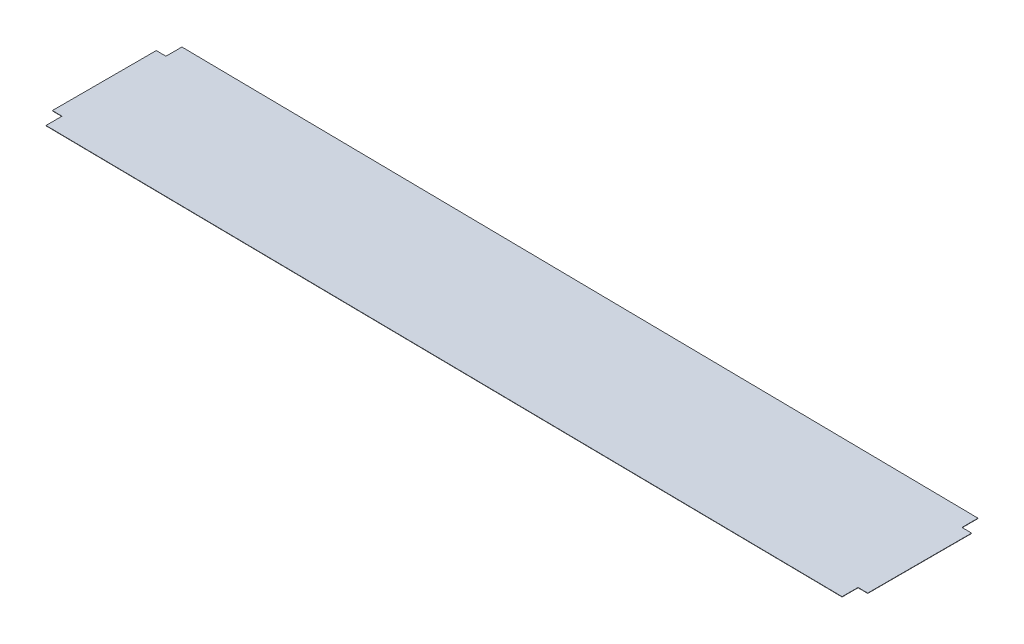
ISO-10303-21;
HEADER;
FILE_DESCRIPTION(('STEP AP214'),'2;1');
FILE_NAME('part.step','',(''),(''),'','','');
FILE_SCHEMA(('AUTOMOTIVE_DESIGN { 1 0 10303 214 1 1 1 1 }'));
ENDSEC;
DATA;
#1=APPLICATION_CONTEXT('core data for automotive mechanical design processes');
#2=APPLICATION_PROTOCOL_DEFINITION('international standard','automotive_design',2000,#1);
#3=PRODUCT_CONTEXT('',#1,'mechanical');
#4=PRODUCT('Part','Part','',(#3));
#5=PRODUCT_RELATED_PRODUCT_CATEGORY('part','',(#4));
#6=PRODUCT_DEFINITION_FORMATION('','',#4);
#7=PRODUCT_DEFINITION_CONTEXT('part definition',#1,'design');
#8=PRODUCT_DEFINITION('design','',#6,#7);
#9=PRODUCT_DEFINITION_SHAPE('','',#8);
#10=(LENGTH_UNIT() NAMED_UNIT(*) SI_UNIT(.MILLI.,.METRE.));
#11=(NAMED_UNIT(*) PLANE_ANGLE_UNIT() SI_UNIT($,.RADIAN.));
#12=(NAMED_UNIT(*) SI_UNIT($,.STERADIAN.) SOLID_ANGLE_UNIT());
#13=UNCERTAINTY_MEASURE_WITH_UNIT(LENGTH_MEASURE(1.E-05),#10,'distance_accuracy_value','');
#14=(GEOMETRIC_REPRESENTATION_CONTEXT(3) GLOBAL_UNCERTAINTY_ASSIGNED_CONTEXT((#13)) GLOBAL_UNIT_ASSIGNED_CONTEXT((#10,
#11,#12)) REPRESENTATION_CONTEXT('',''));
#15=CARTESIAN_POINT('',(0.,0.,0.));
#16=DIRECTION('',(0.,0.,1.));
#17=DIRECTION('',(1.,0.,0.));
#18=AXIS2_PLACEMENT_3D('',#15,#16,#17);
#19=CARTESIAN_POINT('',(-2.0251923119604,-160.765843728774,74.));
#20=DIRECTION('',(0.999920665280262,-0.0125961559801988,0.));
#21=DIRECTION('',(0.,0.,1.));
#22=AXIS2_PLACEMENT_3D('',#19,#20,#21);
#23=PLANE('',#22);
#24=DIRECTION('',(0.,0.,1.));
#25=VECTOR('',#24,1.);
#26=CARTESIAN_POINT('',(-2.03023077435248,-161.165811994886,74.));
#27=LINE('',#26,#25);
#28=CARTESIAN_POINT('',(-2.03023077435246,-161.165811994887,216.359309142724));
#29=VERTEX_POINT('',#28);
#30=CARTESIAN_POINT('',(-2.03023077435249,-161.165811994887,236.359309142724));
#31=VERTEX_POINT('',#30);
#32=EDGE_CURVE('E159',#29,#31,#27,.T.);
#33=ORIENTED_EDGE('',*,*,#32,.F.);
#34=DIRECTION('',(0.0125961559801988,0.999920665280262,0.));
#35=VECTOR('',#34,1.);
#36=CARTESIAN_POINT('',(-2.03023077435246,-161.165811994887,216.359309142724));
#37=LINE('',#36,#35);
#38=CARTESIAN_POINT('',(-2.0251923119604,-160.765843728774,216.359309142724));
#39=VERTEX_POINT('',#38);
#40=EDGE_CURVE('E144',#29,#39,#37,.T.);
#41=ORIENTED_EDGE('',*,*,#40,.T.);
#42=DIRECTION('',(0.,0.,1.));
#43=VECTOR('',#42,1.);
#44=CARTESIAN_POINT('',(-2.0251923119604,-160.765843728774,74.));
#45=LINE('',#44,#43);
#46=CARTESIAN_POINT('',(-2.02519231196041,-160.765843728775,236.359309142724));
#47=VERTEX_POINT('',#46);
#48=EDGE_CURVE('E178',#39,#47,#45,.T.);
#49=ORIENTED_EDGE('',*,*,#48,.T.);
#50=DIRECTION('',(-0.0125961559801988,-0.999920665280262,0.));
#51=VECTOR('',#50,1.);
#52=CARTESIAN_POINT('',(-2.02519231196041,-160.765843728775,236.359309142724));
#53=LINE('',#52,#51);
#54=EDGE_CURVE('E167',#47,#31,#53,.T.);
#55=ORIENTED_EDGE('',*,*,#54,.T.);
#56=EDGE_LOOP('',(#33,#41,#49,#55));
#57=FACE_BOUND('',#56,.T.);
#58=ADVANCED_FACE('F55',(#57),#23,.T.);
#59=CARTESIAN_POINT('',(-996.264935971483,-148.241251200888,74.));
#60=DIRECTION('',(0.999920665280262,-0.0125961559801988,0.));
#61=DIRECTION('',(0.,0.,1.));
#62=AXIS2_PLACEMENT_3D('',#59,#60,#61);
#63=PLANE('',#62);
#64=DIRECTION('',(0.,0.,1.));
#65=VECTOR('',#64,1.);
#66=CARTESIAN_POINT('',(-996.269974433876,-148.641219467,74.));
#67=LINE('',#66,#65);
#68=CARTESIAN_POINT('',(-996.269974433876,-148.641219467,66.61));
#69=VERTEX_POINT('',#68);
#70=CARTESIAN_POINT('',(-996.269974433876,-148.641219467,86.61));
#71=VERTEX_POINT('',#70);
#72=EDGE_CURVE('E13',#69,#71,#67,.T.);
#73=ORIENTED_EDGE('',*,*,#72,.T.);
#74=DIRECTION('',(0.0125961559801988,0.999920665280262,0.));
#75=VECTOR('',#74,1.);
#76=CARTESIAN_POINT('',(-996.269974433876,-148.641219467,86.61));
#77=LINE('',#76,#75);
#78=CARTESIAN_POINT('',(-996.264935971483,-148.241251200888,86.61));
#79=VERTEX_POINT('',#78);
#80=EDGE_CURVE('E213',#71,#79,#77,.T.);
#81=ORIENTED_EDGE('',*,*,#80,.T.);
#82=DIRECTION('',(0.,0.,1.));
#83=VECTOR('',#82,1.);
#84=CARTESIAN_POINT('',(-996.264935971483,-148.241251200888,74.));
#85=LINE('',#84,#83);
#86=CARTESIAN_POINT('',(-996.264935971483,-148.241251200888,66.61));
#87=VERTEX_POINT('',#86);
#88=EDGE_CURVE('E59',#87,#79,#85,.T.);
#89=ORIENTED_EDGE('',*,*,#88,.F.);
#90=DIRECTION('',(-0.0125961559801988,-0.999920665280262,0.));
#91=VECTOR('',#90,1.);
#92=CARTESIAN_POINT('',(-996.264935971483,-148.241251200888,66.61));
#93=LINE('',#92,#91);
#94=EDGE_CURVE('E174',#87,#69,#93,.T.);
#95=ORIENTED_EDGE('',*,*,#94,.T.);
#96=EDGE_LOOP('',(#73,#81,#89,#95));
#97=FACE_BOUND('',#96,.T.);
#98=ADVANCED_FACE('F269',(#97),#63,.F.);
#99=DIRECTION('',(0.0125961559801988,0.999920665280262,0.));
#100=VECTOR('',#99,1.);
#101=CARTESIAN_POINT('',(-2.03023077435248,-161.165811994886,86.61));
#102=LINE('',#101,#100);
#103=CARTESIAN_POINT('',(-2.03023077435248,-161.165811994886,86.61));
#104=VERTEX_POINT('',#103);
#105=CARTESIAN_POINT('',(-2.0251923119604,-160.765843728774,86.61));
#106=VERTEX_POINT('',#105);
#107=EDGE_CURVE('E224',#104,#106,#102,.T.);
#108=ORIENTED_EDGE('',*,*,#107,.F.);
#109=CARTESIAN_POINT('',(-2.03023077435248,-161.165811994886,66.61));
#110=VERTEX_POINT('',#109);
#111=EDGE_CURVE('E169',#110,#104,#27,.T.);
#112=ORIENTED_EDGE('',*,*,#111,.F.);
#113=DIRECTION('',(-0.0125961559801988,-0.999920665280262,0.));
#114=VECTOR('',#113,1.);
#115=CARTESIAN_POINT('',(-2.0251923119604,-160.765843728774,66.61));
#116=LINE('',#115,#114);
#117=CARTESIAN_POINT('',(-2.0251923119604,-160.765843728774,66.61));
#118=VERTEX_POINT('',#117);
#119=EDGE_CURVE('E183',#118,#110,#116,.T.);
#120=ORIENTED_EDGE('',*,*,#119,.F.);
#121=EDGE_CURVE('E176',#118,#106,#45,.T.);
#122=ORIENTED_EDGE('',*,*,#121,.T.);
#123=EDGE_LOOP('',(#108,#112,#120,#122));
#124=FACE_BOUND('',#123,.T.);
#125=ADVANCED_FACE('F248',(#124),#23,.T.);
#126=DIRECTION('',(0.0125961559801988,0.999920665280262,0.));
#127=VECTOR('',#126,1.);
#128=CARTESIAN_POINT('',(-996.269974433876,-148.641219467001,216.359309142724));
#129=LINE('',#128,#127);
#130=CARTESIAN_POINT('',(-996.269974433876,-148.641219467001,216.359309142724));
#131=VERTEX_POINT('',#130);
#132=CARTESIAN_POINT('',(-996.264935971484,-148.241251200889,216.359309142724));
#133=VERTEX_POINT('',#132);
#134=EDGE_CURVE('E205',#131,#133,#129,.T.);
#135=ORIENTED_EDGE('',*,*,#134,.F.);
#136=CARTESIAN_POINT('',(-996.269974433876,-148.641219467001,236.359309142724));
#137=VERTEX_POINT('',#136);
#138=EDGE_CURVE('E64',#131,#137,#67,.T.);
#139=ORIENTED_EDGE('',*,*,#138,.T.);
#140=DIRECTION('',(-0.0125961559801988,-0.999920665280262,0.));
#141=VECTOR('',#140,1.);
#142=CARTESIAN_POINT('',(-996.264935971483,-148.241251200889,236.359309142724));
#143=LINE('',#142,#141);
#144=CARTESIAN_POINT('',(-996.264935971483,-148.241251200889,236.359309142724));
#145=VERTEX_POINT('',#144);
#146=EDGE_CURVE('E197',#145,#137,#143,.T.);
#147=ORIENTED_EDGE('',*,*,#146,.F.);
#148=EDGE_CURVE('E172',#133,#145,#85,.T.);
#149=ORIENTED_EDGE('',*,*,#148,.F.);
#150=EDGE_LOOP('',(#135,#139,#147,#149));
#151=FACE_BOUND('',#150,.T.);
#152=ADVANCED_FACE('F261',(#151),#63,.F.);
#153=CARTESIAN_POINT('',(-2.03023077435248,-161.165811994886,74.));
#154=DIRECTION('',(-0.0125961559801988,-0.999920665280262,0.));
#155=DIRECTION('',(0.999920665280262,-0.0125961559801988,0.));
#156=AXIS2_PLACEMENT_3D('',#153,#154,#155);
#157=PLANE('',#156);
#158=ORIENTED_EDGE('',*,*,#111,.T.);
#159=DIRECTION('',(-0.999920665280262,0.0125961559802,0.));
#160=VECTOR('',#159,1.);
#161=CARTESIAN_POINT('',(-2.03023077435248,-161.165811994886,86.61));
#162=LINE('',#161,#160);
#163=CARTESIAN_POINT('',(9.96881720901067,-161.316965866649,86.61));
#164=VERTEX_POINT('',#163);
#165=EDGE_CURVE('E152',#164,#104,#162,.T.);
#166=ORIENTED_EDGE('',*,*,#165,.F.);
#167=DIRECTION('',(0.,0.,-1.));
#168=VECTOR('',#167,1.);
#169=CARTESIAN_POINT('',(9.96881720901067,-161.316965866649,86.61));
#170=LINE('',#169,#168);
#171=CARTESIAN_POINT('',(9.96881720901068,-161.316965866649,216.359309142724));
#172=VERTEX_POINT('',#171);
#173=EDGE_CURVE('E163',#172,#164,#170,.T.);
#174=ORIENTED_EDGE('',*,*,#173,.F.);
#175=DIRECTION('',(0.999920665280262,-0.0125961559801976,0.));
#176=VECTOR('',#175,1.);
#177=CARTESIAN_POINT('',(-2.03023077435246,-161.165811994887,216.359309142724));
#178=LINE('',#177,#176);
#179=EDGE_CURVE('E147',#29,#172,#178,.T.);
#180=ORIENTED_EDGE('',*,*,#179,.F.);
#181=ORIENTED_EDGE('',*,*,#32,.T.);
#182=DIRECTION('',(0.999920665280262,-0.0125961559801988,0.));
#183=VECTOR('',#182,1.);
#184=CARTESIAN_POINT('',(-2.03023077435249,-161.165811994887,236.359309142724));
#185=LINE('',#184,#183);
#186=EDGE_CURVE('E200',#31,#137,#185,.F.);
#187=ORIENTED_EDGE('',*,*,#186,.T.);
#188=ORIENTED_EDGE('',*,*,#138,.F.);
#189=DIRECTION('',(-0.999920665280262,0.0125961559802001,0.));
#190=VECTOR('',#189,1.);
#191=CARTESIAN_POINT('',(-996.269974433876,-148.641219467001,216.359309142724));
#192=LINE('',#191,#190);
#193=CARTESIAN_POINT('',(-1008.26902241724,-148.490065595238,216.359309142724));
#194=VERTEX_POINT('',#193);
#195=EDGE_CURVE('E217',#131,#194,#192,.T.);
#196=ORIENTED_EDGE('',*,*,#195,.T.);
#197=DIRECTION('',(0.,0.,1.));
#198=VECTOR('',#197,1.);
#199=CARTESIAN_POINT('',(-1008.26902241724,-148.490065595238,86.61));
#200=LINE('',#199,#198);
#201=CARTESIAN_POINT('',(-1008.26902241724,-148.490065595238,86.61));
#202=VERTEX_POINT('',#201);
#203=EDGE_CURVE('E227',#202,#194,#200,.T.);
#204=ORIENTED_EDGE('',*,*,#203,.F.);
#205=DIRECTION('',(-0.999920665280262,0.0125961559801978,0.));
#206=VECTOR('',#205,1.);
#207=CARTESIAN_POINT('',(-996.269974433876,-148.641219467,86.61));
#208=LINE('',#207,#206);
#209=EDGE_CURVE('E215',#71,#202,#208,.T.);
#210=ORIENTED_EDGE('',*,*,#209,.F.);
#211=ORIENTED_EDGE('',*,*,#72,.F.);
#212=DIRECTION('',(0.999920665280262,-0.0125961559801988,0.));
#213=VECTOR('',#212,1.);
#214=CARTESIAN_POINT('',(-2.03023077435248,-161.165811994886,66.61));
#215=LINE('',#214,#213);
#216=EDGE_CURVE('E188',#110,#69,#215,.F.);
#217=ORIENTED_EDGE('',*,*,#216,.F.);
#218=EDGE_LOOP('',(#158,#166,#174,#180,#181,#187,#188,#196,#204,#210,#211,#217));
#219=FACE_BOUND('',#218,.T.);
#220=ADVANCED_FACE('F157',(#219),#157,.T.);
#221=CARTESIAN_POINT('',(-2.0251923119604,-160.765843728774,75.));
#222=DIRECTION('',(-0.0125961559801988,-0.999920665280262,0.));
#223=DIRECTION('',(0.999920665280262,-0.0125961559801988,0.));
#224=AXIS2_PLACEMENT_3D('',#221,#222,#223);
#225=PLANE('',#224);
#226=ORIENTED_EDGE('',*,*,#88,.T.);
#227=DIRECTION('',(-0.999920665280262,0.0125961559801978,0.));
#228=VECTOR('',#227,1.);
#229=CARTESIAN_POINT('',(-996.264935971484,-148.241251200888,86.61));
#230=LINE('',#229,#228);
#231=CARTESIAN_POINT('',(-1008.26398395485,-148.090097329126,86.61));
#232=VERTEX_POINT('',#231);
#233=EDGE_CURVE('E80',#79,#232,#230,.T.);
#234=ORIENTED_EDGE('',*,*,#233,.T.);
#235=DIRECTION('',(0.,0.,1.));
#236=VECTOR('',#235,1.);
#237=CARTESIAN_POINT('',(-1008.26398395485,-148.090097329126,86.61));
#238=LINE('',#237,#236);
#239=CARTESIAN_POINT('',(-1008.26398395485,-148.090097329126,216.359309142724));
#240=VERTEX_POINT('',#239);
#241=EDGE_CURVE('E218',#232,#240,#238,.T.);
#242=ORIENTED_EDGE('',*,*,#241,.T.);
#243=DIRECTION('',(-0.999920665280262,0.0125961559802001,0.));
#244=VECTOR('',#243,1.);
#245=CARTESIAN_POINT('',(-996.264935971484,-148.241251200889,216.359309142724));
#246=LINE('',#245,#244);
#247=EDGE_CURVE('E221',#133,#240,#246,.T.);
#248=ORIENTED_EDGE('',*,*,#247,.F.);
#249=ORIENTED_EDGE('',*,*,#148,.T.);
#250=DIRECTION('',(-0.999920665280262,0.0125961559801988,0.));
#251=VECTOR('',#250,1.);
#252=CARTESIAN_POINT('',(-2.02519231196041,-160.765843728775,236.359309142724));
#253=LINE('',#252,#251);
#254=EDGE_CURVE('E202',#47,#145,#253,.T.);
#255=ORIENTED_EDGE('',*,*,#254,.F.);
#256=ORIENTED_EDGE('',*,*,#48,.F.);
#257=DIRECTION('',(0.999920665280262,-0.0125961559801976,0.));
#258=VECTOR('',#257,1.);
#259=CARTESIAN_POINT('',(-2.02519231196038,-160.765843728775,216.359309142724));
#260=LINE('',#259,#258);
#261=CARTESIAN_POINT('',(9.97385567140276,-160.916997600537,216.359309142724));
#262=VERTEX_POINT('',#261);
#263=EDGE_CURVE('E72',#39,#262,#260,.T.);
#264=ORIENTED_EDGE('',*,*,#263,.T.);
#265=DIRECTION('',(0.,0.,-1.));
#266=VECTOR('',#265,1.);
#267=CARTESIAN_POINT('',(9.97385567140275,-160.916997600537,86.61));
#268=LINE('',#267,#266);
#269=CARTESIAN_POINT('',(9.97385567140275,-160.916997600537,86.61));
#270=VERTEX_POINT('',#269);
#271=EDGE_CURVE('E237',#262,#270,#268,.T.);
#272=ORIENTED_EDGE('',*,*,#271,.T.);
#273=DIRECTION('',(-0.999920665280262,0.0125961559802,0.));
#274=VECTOR('',#273,1.);
#275=CARTESIAN_POINT('',(-2.0251923119604,-160.765843728774,86.61));
#276=LINE('',#275,#274);
#277=EDGE_CURVE('E164',#270,#106,#276,.T.);
#278=ORIENTED_EDGE('',*,*,#277,.T.);
#279=ORIENTED_EDGE('',*,*,#121,.F.);
#280=DIRECTION('',(-0.999920665280262,0.0125961559801988,0.));
#281=VECTOR('',#280,1.);
#282=CARTESIAN_POINT('',(-2.0251923119604,-160.765843728774,66.61));
#283=LINE('',#282,#281);
#284=EDGE_CURVE('E192',#118,#87,#283,.T.);
#285=ORIENTED_EDGE('',*,*,#284,.T.);
#286=EDGE_LOOP('',(#226,#234,#242,#248,#249,#255,#256,#264,#272,#278,#279,#285));
#287=FACE_BOUND('',#286,.T.);
#288=ADVANCED_FACE('F57',(#287),#225,.F.);
#289=CARTESIAN_POINT('',(-2.0251923119604,-160.765843728774,66.61));
#290=DIRECTION('',(0.,0.,1.));
#291=DIRECTION('',(-0.999920665280262,0.0125961559801988,0.));
#292=AXIS2_PLACEMENT_3D('',#289,#290,#291);
#293=PLANE('',#292);
#294=ORIENTED_EDGE('',*,*,#94,.F.);
#295=ORIENTED_EDGE('',*,*,#284,.F.);
#296=ORIENTED_EDGE('',*,*,#119,.T.);
#297=ORIENTED_EDGE('',*,*,#216,.T.);
#298=EDGE_LOOP('',(#294,#295,#296,#297));
#299=FACE_BOUND('',#298,.T.);
#300=ADVANCED_FACE('F249',(#299),#293,.F.);
#301=CARTESIAN_POINT('',(-2.02519231196041,-160.765843728775,236.359309142724));
#302=DIRECTION('',(0.,0.,1.));
#303=DIRECTION('',(-0.999920665280262,0.0125961559801988,0.));
#304=AXIS2_PLACEMENT_3D('',#301,#302,#303);
#305=PLANE('',#304);
#306=ORIENTED_EDGE('',*,*,#54,.F.);
#307=ORIENTED_EDGE('',*,*,#254,.T.);
#308=ORIENTED_EDGE('',*,*,#146,.T.);
#309=ORIENTED_EDGE('',*,*,#186,.F.);
#310=EDGE_LOOP('',(#306,#307,#308,#309));
#311=FACE_BOUND('',#310,.T.);
#312=ADVANCED_FACE('F255',(#311),#305,.T.);
#313=CARTESIAN_POINT('',(-996.269974433876,-148.641219467001,216.359309142724));
#314=DIRECTION('',(0.,0.,-1.));
#315=DIRECTION('',(0.,1.,0.));
#316=AXIS2_PLACEMENT_3D('',#313,#314,#315);
#317=PLANE('',#316);
#318=ORIENTED_EDGE('',*,*,#247,.T.);
#319=DIRECTION('',(0.0125961559801988,0.999920665280262,0.));
#320=VECTOR('',#319,1.);
#321=CARTESIAN_POINT('',(-1008.26902241724,-148.490065595238,216.359309142724));
#322=LINE('',#321,#320);
#323=EDGE_CURVE('E209',#194,#240,#322,.T.);
#324=ORIENTED_EDGE('',*,*,#323,.F.);
#325=ORIENTED_EDGE('',*,*,#195,.F.);
#326=ORIENTED_EDGE('',*,*,#134,.T.);
#327=EDGE_LOOP('',(#318,#324,#325,#326));
#328=FACE_BOUND('',#327,.T.);
#329=ADVANCED_FACE('F263',(#328),#317,.F.);
#330=CARTESIAN_POINT('',(-1008.26902241724,-148.490065595238,86.61));
#331=DIRECTION('',(-0.999920665280262,0.0125961559801988,0.));
#332=DIRECTION('',(-0.0125961559801988,-0.999920665280262,0.));
#333=AXIS2_PLACEMENT_3D('',#330,#331,#332);
#334=PLANE('',#333);
#335=ORIENTED_EDGE('',*,*,#241,.F.);
#336=DIRECTION('',(0.0125961559801988,0.999920665280262,0.));
#337=VECTOR('',#336,1.);
#338=CARTESIAN_POINT('',(-1008.26902241724,-148.490065595238,86.61));
#339=LINE('',#338,#337);
#340=EDGE_CURVE('E211',#202,#232,#339,.T.);
#341=ORIENTED_EDGE('',*,*,#340,.F.);
#342=ORIENTED_EDGE('',*,*,#203,.T.);
#343=ORIENTED_EDGE('',*,*,#323,.T.);
#344=EDGE_LOOP('',(#335,#341,#342,#343));
#345=FACE_BOUND('',#344,.T.);
#346=ADVANCED_FACE('F266',(#345),#334,.T.);
#347=CARTESIAN_POINT('',(-996.269974433876,-148.641219467,86.61));
#348=DIRECTION('',(0.,0.,-1.));
#349=DIRECTION('',(0.,1.,0.));
#350=AXIS2_PLACEMENT_3D('',#347,#348,#349);
#351=PLANE('',#350);
#352=ORIENTED_EDGE('',*,*,#233,.F.);
#353=ORIENTED_EDGE('',*,*,#80,.F.);
#354=ORIENTED_EDGE('',*,*,#209,.T.);
#355=ORIENTED_EDGE('',*,*,#340,.T.);
#356=EDGE_LOOP('',(#352,#353,#354,#355));
#357=FACE_BOUND('',#356,.T.);
#358=ADVANCED_FACE('F268',(#357),#351,.T.);
#359=CARTESIAN_POINT('',(-2.03023077435248,-161.165811994886,86.61));
#360=DIRECTION('',(0.,0.,-1.));
#361=DIRECTION('',(0.,1.,0.));
#362=AXIS2_PLACEMENT_3D('',#359,#360,#361);
#363=PLANE('',#362);
#364=ORIENTED_EDGE('',*,*,#277,.F.);
#365=DIRECTION('',(0.0125961559801988,0.999920665280262,0.));
#366=VECTOR('',#365,1.);
#367=CARTESIAN_POINT('',(9.96881720901067,-161.316965866649,86.61));
#368=LINE('',#367,#366);
#369=EDGE_CURVE('E232',#164,#270,#368,.T.);
#370=ORIENTED_EDGE('',*,*,#369,.F.);
#371=ORIENTED_EDGE('',*,*,#165,.T.);
#372=ORIENTED_EDGE('',*,*,#107,.T.);
#373=EDGE_LOOP('',(#364,#370,#371,#372));
#374=FACE_BOUND('',#373,.T.);
#375=ADVANCED_FACE('F247',(#374),#363,.T.);
#376=CARTESIAN_POINT('',(9.96881720901067,-161.316965866649,86.61));
#377=DIRECTION('',(0.999920665280262,-0.0125961559801988,0.));
#378=DIRECTION('',(0.0125961559801988,0.999920665280262,0.));
#379=AXIS2_PLACEMENT_3D('',#376,#377,#378);
#380=PLANE('',#379);
#381=ORIENTED_EDGE('',*,*,#271,.F.);
#382=DIRECTION('',(0.0125961559801988,0.999920665280262,0.));
#383=VECTOR('',#382,1.);
#384=CARTESIAN_POINT('',(9.96881720901068,-161.316965866649,216.359309142724));
#385=LINE('',#384,#383);
#386=EDGE_CURVE('E151',#172,#262,#385,.T.);
#387=ORIENTED_EDGE('',*,*,#386,.F.);
#388=ORIENTED_EDGE('',*,*,#173,.T.);
#389=ORIENTED_EDGE('',*,*,#369,.T.);
#390=EDGE_LOOP('',(#381,#387,#388,#389));
#391=FACE_BOUND('',#390,.T.);
#392=ADVANCED_FACE('F244',(#391),#380,.T.);
#393=CARTESIAN_POINT('',(-2.03023077435246,-161.165811994887,216.359309142724));
#394=DIRECTION('',(0.,0.,1.));
#395=DIRECTION('',(0.,-1.,0.));
#396=AXIS2_PLACEMENT_3D('',#393,#394,#395);
#397=PLANE('',#396);
#398=ORIENTED_EDGE('',*,*,#263,.F.);
#399=ORIENTED_EDGE('',*,*,#40,.F.);
#400=ORIENTED_EDGE('',*,*,#179,.T.);
#401=ORIENTED_EDGE('',*,*,#386,.T.);
#402=EDGE_LOOP('',(#398,#399,#400,#401));
#403=FACE_BOUND('',#402,.T.);
#404=ADVANCED_FACE('F146',(#403),#397,.T.);
#405=CLOSED_SHELL('',(#58,#98,#125,#152,#220,#288,#300,#312,#329,#346,#358,#375,#392,#404));
#406=MANIFOLD_SOLID_BREP('B2',#405);
#407=ADVANCED_BREP_SHAPE_REPRESENTATION('',(#18,#406),#14);
#408=SHAPE_DEFINITION_REPRESENTATION(#9,#407);
ENDSEC;
END-ISO-10303-21;
